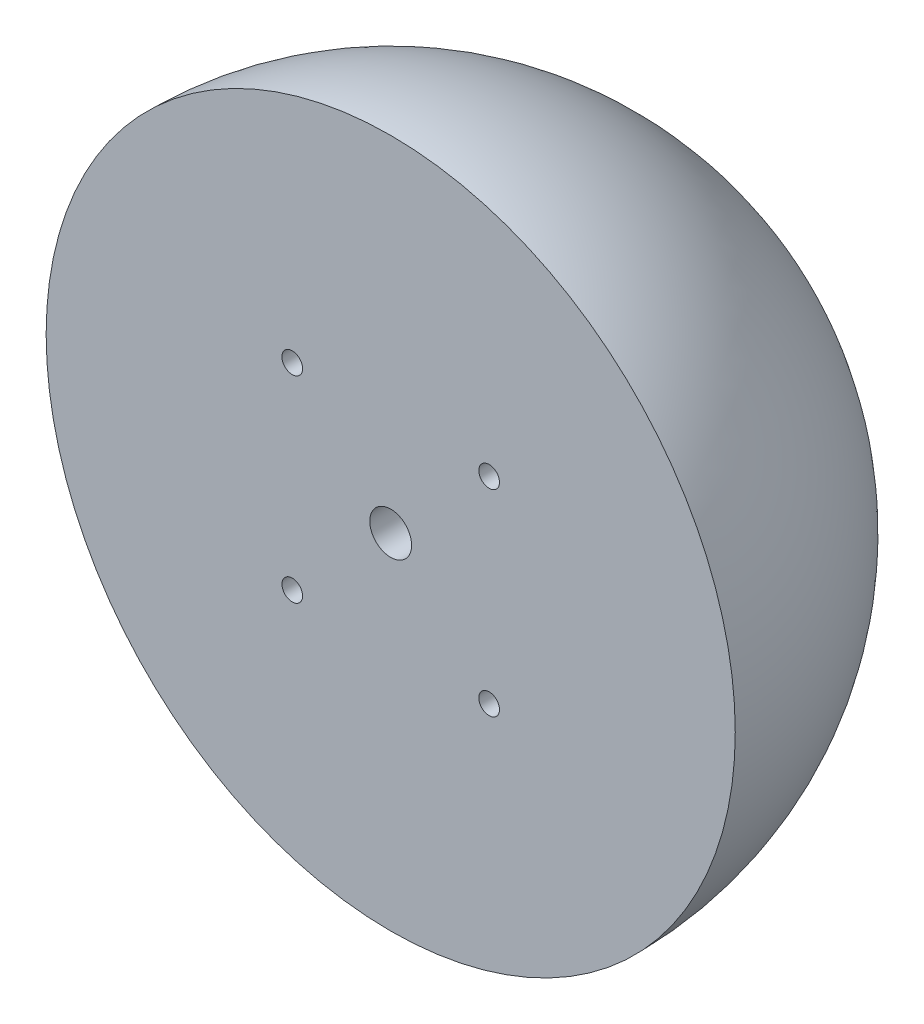
ISO-10303-21;
HEADER;
FILE_DESCRIPTION(('STEP AP214'),'2;1');
FILE_NAME('part.step','',(''),(''),'','','');
FILE_SCHEMA(('AUTOMOTIVE_DESIGN { 1 0 10303 214 1 1 1 1 }'));
ENDSEC;
DATA;
#1=APPLICATION_CONTEXT('core data for automotive mechanical design processes');
#2=APPLICATION_PROTOCOL_DEFINITION('international standard','automotive_design',2000,#1);
#3=PRODUCT_CONTEXT('',#1,'mechanical');
#4=PRODUCT('Part','Part','',(#3));
#5=PRODUCT_RELATED_PRODUCT_CATEGORY('part','',(#4));
#6=PRODUCT_DEFINITION_FORMATION('','',#4);
#7=PRODUCT_DEFINITION_CONTEXT('part definition',#1,'design');
#8=PRODUCT_DEFINITION('design','',#6,#7);
#9=PRODUCT_DEFINITION_SHAPE('','',#8);
#10=(LENGTH_UNIT() NAMED_UNIT(*) SI_UNIT(.MILLI.,.METRE.));
#11=(NAMED_UNIT(*) PLANE_ANGLE_UNIT() SI_UNIT($,.RADIAN.));
#12=(NAMED_UNIT(*) SI_UNIT($,.STERADIAN.) SOLID_ANGLE_UNIT());
#13=UNCERTAINTY_MEASURE_WITH_UNIT(LENGTH_MEASURE(1.E-05),#10,'distance_accuracy_value','');
#14=(GEOMETRIC_REPRESENTATION_CONTEXT(3) GLOBAL_UNCERTAINTY_ASSIGNED_CONTEXT((#13)) GLOBAL_UNIT_ASSIGNED_CONTEXT((#10,
#11,#12)) REPRESENTATION_CONTEXT('',''));
#15=CARTESIAN_POINT('',(0.,0.,0.));
#16=DIRECTION('',(0.,0.,1.));
#17=DIRECTION('',(1.,0.,0.));
#18=AXIS2_PLACEMENT_3D('',#15,#16,#17);
#19=CARTESIAN_POINT('',(0.,0.,0.));
#20=DIRECTION('',(0.,0.,-1.));
#21=DIRECTION('',(-1.,0.,0.));
#22=AXIS2_PLACEMENT_3D('',#19,#20,#21);
#23=PLANE('',#22);
#24=CARTESIAN_POINT('',(-20.,20.,0.));
#25=DIRECTION('',(0.,0.,1.));
#26=DIRECTION('',(1.,0.,0.));
#27=AXIS2_PLACEMENT_3D('',#24,#25,#26);
#28=CIRCLE('',#27,2.1);
#29=CARTESIAN_POINT('',(-17.9,20.,0.));
#30=VERTEX_POINT('',#29);
#31=EDGE_CURVE('E70',#30,#30,#28,.T.);
#32=ORIENTED_EDGE('',*,*,#31,.F.);
#33=EDGE_LOOP('',(#32));
#34=FACE_BOUND('',#33,.T.);
#35=CARTESIAN_POINT('',(20.,20.,0.));
#36=DIRECTION('',(0.,0.,1.));
#37=DIRECTION('',(1.,0.,0.));
#38=AXIS2_PLACEMENT_3D('',#35,#36,#37);
#39=CIRCLE('',#38,2.1);
#40=CARTESIAN_POINT('',(22.1,20.,0.));
#41=VERTEX_POINT('',#40);
#42=EDGE_CURVE('E69',#41,#41,#39,.T.);
#43=ORIENTED_EDGE('',*,*,#42,.F.);
#44=EDGE_LOOP('',(#43));
#45=FACE_BOUND('',#44,.T.);
#46=CARTESIAN_POINT('',(20.,-20.,0.));
#47=DIRECTION('',(0.,0.,1.));
#48=DIRECTION('',(1.,0.,0.));
#49=AXIS2_PLACEMENT_3D('',#46,#47,#48);
#50=CIRCLE('',#49,2.1);
#51=CARTESIAN_POINT('',(22.1,-20.,0.));
#52=VERTEX_POINT('',#51);
#53=EDGE_CURVE('E80',#52,#52,#50,.T.);
#54=ORIENTED_EDGE('',*,*,#53,.F.);
#55=EDGE_LOOP('',(#54));
#56=FACE_BOUND('',#55,.T.);
#57=CARTESIAN_POINT('',(-20.,-20.,0.));
#58=DIRECTION('',(0.,0.,1.));
#59=DIRECTION('',(1.,0.,0.));
#60=AXIS2_PLACEMENT_3D('',#57,#58,#59);
#61=CIRCLE('',#60,2.1);
#62=CARTESIAN_POINT('',(-17.9,-20.,0.));
#63=VERTEX_POINT('',#62);
#64=EDGE_CURVE('E86',#63,#63,#61,.T.);
#65=ORIENTED_EDGE('',*,*,#64,.F.);
#66=EDGE_LOOP('',(#65));
#67=FACE_BOUND('',#66,.T.);
#68=CARTESIAN_POINT('',(0.,0.,0.));
#69=DIRECTION('',(0.,0.,1.));
#70=DIRECTION('',(1.,0.,0.));
#71=AXIS2_PLACEMENT_3D('',#68,#69,#70);
#72=CIRCLE('',#71,4.24999999999999);
#73=CARTESIAN_POINT('',(4.24999999999999,0.,0.));
#74=VERTEX_POINT('',#73);
#75=EDGE_CURVE('E92',#74,#74,#72,.T.);
#76=ORIENTED_EDGE('',*,*,#75,.F.);
#77=EDGE_LOOP('',(#76));
#78=FACE_BOUND('',#77,.T.);
#79=CARTESIAN_POINT('',(0.,0.,0.));
#80=DIRECTION('',(0.,0.,-1.));
#81=DIRECTION('',(-1.,0.,0.));
#82=AXIS2_PLACEMENT_3D('',#79,#80,#81);
#83=CIRCLE('',#82,70.);
#84=CARTESIAN_POINT('',(-70.,0.,0.));
#85=VERTEX_POINT('',#84);
#86=EDGE_CURVE('E11',#85,#85,#83,.T.);
#87=ORIENTED_EDGE('',*,*,#86,.F.);
#88=EDGE_LOOP('',(#87));
#89=FACE_BOUND('',#88,.T.);
#90=ADVANCED_FACE('F36',(#34,#45,#56,#67,#78,#89),#23,.F.);
#91=CARTESIAN_POINT('',(0.,0.,0.));
#92=DIRECTION('',(0.,0.,-1.));
#93=DIRECTION('',(1.,0.,0.));
#94=AXIS2_PLACEMENT_3D('',#91,#92,#93);
#95=SPHERICAL_SURFACE('',#94,70.);
#96=ORIENTED_EDGE('',*,*,#86,.T.);
#97=EDGE_LOOP('',(#96));
#98=FACE_BOUND('',#97,.T.);
#99=ADVANCED_FACE('F108',(#98),#95,.T.);
#100=CARTESIAN_POINT('',(0.,0.,-30.));
#101=DIRECTION('',(0.,0.,1.));
#102=DIRECTION('',(1.,0.,0.));
#103=AXIS2_PLACEMENT_3D('',#100,#101,#102);
#104=CONICAL_SURFACE('',#103,4.24999999999999,1.02974425867665);
#105=CARTESIAN_POINT('',(0.,0.,-32.5536576308671));
#106=VERTEX_POINT('',#105);
#107=VERTEX_LOOP('',#106);
#108=FACE_BOUND('',#107,.T.);
#109=CARTESIAN_POINT('',(0.,0.,-30.));
#110=DIRECTION('',(0.,0.,1.));
#111=DIRECTION('',(1.,0.,0.));
#112=AXIS2_PLACEMENT_3D('',#109,#110,#111);
#113=CIRCLE('',#112,4.24999999999999);
#114=CARTESIAN_POINT('',(4.24999999999999,0.,-30.));
#115=VERTEX_POINT('',#114);
#116=EDGE_CURVE('E43',#115,#115,#113,.T.);
#117=ORIENTED_EDGE('',*,*,#116,.T.);
#118=EDGE_LOOP('',(#117));
#119=FACE_BOUND('',#118,.T.);
#120=ADVANCED_FACE('F97',(#108,#119),#104,.F.);
#121=CARTESIAN_POINT('',(0.,0.,0.));
#122=DIRECTION('',(0.,0.,1.));
#123=DIRECTION('',(1.,0.,0.));
#124=AXIS2_PLACEMENT_3D('',#121,#122,#123);
#125=CYLINDRICAL_SURFACE('',#124,4.24999999999999);
#126=ORIENTED_EDGE('',*,*,#116,.F.);
#127=EDGE_LOOP('',(#126));
#128=FACE_BOUND('',#127,.T.);
#129=ORIENTED_EDGE('',*,*,#75,.T.);
#130=EDGE_LOOP('',(#129));
#131=FACE_BOUND('',#130,.T.);
#132=ADVANCED_FACE('F99',(#128,#131),#125,.F.);
#133=CARTESIAN_POINT('',(-20.,-20.,-20.));
#134=DIRECTION('',(0.,0.,1.));
#135=DIRECTION('',(1.,0.,0.));
#136=AXIS2_PLACEMENT_3D('',#133,#134,#135);
#137=CONICAL_SURFACE('',#136,2.09999999999999,1.02974425867665);
#138=CARTESIAN_POINT('',(-20.,-20.,-21.2618072999579));
#139=VERTEX_POINT('',#138);
#140=VERTEX_LOOP('',#139);
#141=FACE_BOUND('',#140,.T.);
#142=CARTESIAN_POINT('',(-20.,-20.,-20.));
#143=DIRECTION('',(0.,0.,1.));
#144=DIRECTION('',(1.,0.,0.));
#145=AXIS2_PLACEMENT_3D('',#142,#143,#144);
#146=CIRCLE('',#145,2.09999999999999);
#147=CARTESIAN_POINT('',(-17.9,-20.,-20.));
#148=VERTEX_POINT('',#147);
#149=EDGE_CURVE('E89',#148,#148,#146,.T.);
#150=ORIENTED_EDGE('',*,*,#149,.T.);
#151=EDGE_LOOP('',(#150));
#152=FACE_BOUND('',#151,.T.);
#153=ADVANCED_FACE('F102',(#141,#152),#137,.F.);
#154=CARTESIAN_POINT('',(-20.,-20.,0.));
#155=DIRECTION('',(0.,0.,1.));
#156=DIRECTION('',(1.,0.,0.));
#157=AXIS2_PLACEMENT_3D('',#154,#155,#156);
#158=CYLINDRICAL_SURFACE('',#157,2.1);
#159=ORIENTED_EDGE('',*,*,#149,.F.);
#160=EDGE_LOOP('',(#159));
#161=FACE_BOUND('',#160,.T.);
#162=ORIENTED_EDGE('',*,*,#64,.T.);
#163=EDGE_LOOP('',(#162));
#164=FACE_BOUND('',#163,.T.);
#165=ADVANCED_FACE('F120',(#161,#164),#158,.F.);
#166=CARTESIAN_POINT('',(20.,-20.,-20.));
#167=DIRECTION('',(0.,0.,1.));
#168=DIRECTION('',(1.,0.,0.));
#169=AXIS2_PLACEMENT_3D('',#166,#167,#168);
#170=CONICAL_SURFACE('',#169,2.09999999999999,1.02974425867665);
#171=CARTESIAN_POINT('',(20.,-20.,-21.2618072999579));
#172=VERTEX_POINT('',#171);
#173=VERTEX_LOOP('',#172);
#174=FACE_BOUND('',#173,.T.);
#175=CARTESIAN_POINT('',(20.,-20.,-20.));
#176=DIRECTION('',(0.,0.,1.));
#177=DIRECTION('',(1.,0.,0.));
#178=AXIS2_PLACEMENT_3D('',#175,#176,#177);
#179=CIRCLE('',#178,2.09999999999999);
#180=CARTESIAN_POINT('',(22.1,-20.,-20.));
#181=VERTEX_POINT('',#180);
#182=EDGE_CURVE('E83',#181,#181,#179,.T.);
#183=ORIENTED_EDGE('',*,*,#182,.T.);
#184=EDGE_LOOP('',(#183));
#185=FACE_BOUND('',#184,.T.);
#186=ADVANCED_FACE('F123',(#174,#185),#170,.F.);
#187=CARTESIAN_POINT('',(20.,-20.,0.));
#188=DIRECTION('',(0.,0.,1.));
#189=DIRECTION('',(1.,0.,0.));
#190=AXIS2_PLACEMENT_3D('',#187,#188,#189);
#191=CYLINDRICAL_SURFACE('',#190,2.1);
#192=ORIENTED_EDGE('',*,*,#182,.F.);
#193=EDGE_LOOP('',(#192));
#194=FACE_BOUND('',#193,.T.);
#195=ORIENTED_EDGE('',*,*,#53,.T.);
#196=EDGE_LOOP('',(#195));
#197=FACE_BOUND('',#196,.T.);
#198=ADVANCED_FACE('F127',(#194,#197),#191,.F.);
#199=CARTESIAN_POINT('',(20.,20.,-20.));
#200=DIRECTION('',(0.,0.,1.));
#201=DIRECTION('',(1.,0.,0.));
#202=AXIS2_PLACEMENT_3D('',#199,#200,#201);
#203=CONICAL_SURFACE('',#202,2.09999999999999,1.02974425867665);
#204=CARTESIAN_POINT('',(20.,20.,-21.2618072999579));
#205=VERTEX_POINT('',#204);
#206=VERTEX_LOOP('',#205);
#207=FACE_BOUND('',#206,.T.);
#208=CARTESIAN_POINT('',(20.,20.,-20.));
#209=DIRECTION('',(0.,0.,1.));
#210=DIRECTION('',(1.,0.,0.));
#211=AXIS2_PLACEMENT_3D('',#208,#209,#210);
#212=CIRCLE('',#211,2.09999999999999);
#213=CARTESIAN_POINT('',(22.1,20.,-20.));
#214=VERTEX_POINT('',#213);
#215=EDGE_CURVE('E73',#214,#214,#212,.T.);
#216=ORIENTED_EDGE('',*,*,#215,.T.);
#217=EDGE_LOOP('',(#216));
#218=FACE_BOUND('',#217,.T.);
#219=ADVANCED_FACE('F131',(#207,#218),#203,.F.);
#220=CARTESIAN_POINT('',(20.,20.,0.));
#221=DIRECTION('',(0.,0.,1.));
#222=DIRECTION('',(1.,0.,0.));
#223=AXIS2_PLACEMENT_3D('',#220,#221,#222);
#224=CYLINDRICAL_SURFACE('',#223,2.1);
#225=ORIENTED_EDGE('',*,*,#215,.F.);
#226=EDGE_LOOP('',(#225));
#227=FACE_BOUND('',#226,.T.);
#228=ORIENTED_EDGE('',*,*,#42,.T.);
#229=EDGE_LOOP('',(#228));
#230=FACE_BOUND('',#229,.T.);
#231=ADVANCED_FACE('F63',(#227,#230),#224,.F.);
#232=CARTESIAN_POINT('',(-20.,20.,-20.));
#233=DIRECTION('',(0.,0.,1.));
#234=DIRECTION('',(1.,0.,0.));
#235=AXIS2_PLACEMENT_3D('',#232,#233,#234);
#236=CONICAL_SURFACE('',#235,2.09999999999999,1.02974425867665);
#237=CARTESIAN_POINT('',(-20.,20.,-21.2618072999579));
#238=VERTEX_POINT('',#237);
#239=VERTEX_LOOP('',#238);
#240=FACE_BOUND('',#239,.T.);
#241=CARTESIAN_POINT('',(-20.,20.,-20.));
#242=DIRECTION('',(0.,0.,1.));
#243=DIRECTION('',(1.,0.,0.));
#244=AXIS2_PLACEMENT_3D('',#241,#242,#243);
#245=CIRCLE('',#244,2.09999999999999);
#246=CARTESIAN_POINT('',(-17.9,20.,-20.));
#247=VERTEX_POINT('',#246);
#248=EDGE_CURVE('E67',#247,#247,#245,.T.);
#249=ORIENTED_EDGE('',*,*,#248,.T.);
#250=EDGE_LOOP('',(#249));
#251=FACE_BOUND('',#250,.T.);
#252=ADVANCED_FACE('F59',(#240,#251),#236,.F.);
#253=CARTESIAN_POINT('',(-20.,20.,0.));
#254=DIRECTION('',(0.,0.,1.));
#255=DIRECTION('',(1.,0.,0.));
#256=AXIS2_PLACEMENT_3D('',#253,#254,#255);
#257=CYLINDRICAL_SURFACE('',#256,2.1);
#258=ORIENTED_EDGE('',*,*,#248,.F.);
#259=EDGE_LOOP('',(#258));
#260=FACE_BOUND('',#259,.T.);
#261=ORIENTED_EDGE('',*,*,#31,.T.);
#262=EDGE_LOOP('',(#261));
#263=FACE_BOUND('',#262,.T.);
#264=ADVANCED_FACE('F62',(#260,#263),#257,.F.);
#265=CLOSED_SHELL('',(#90,#99,#120,#132,#153,#165,#186,#198,#219,#231,#252,#264));
#266=MANIFOLD_SOLID_BREP('B2',#265);
#267=ADVANCED_BREP_SHAPE_REPRESENTATION('',(#18,#266),#14);
#268=SHAPE_DEFINITION_REPRESENTATION(#9,#267);
ENDSEC;
END-ISO-10303-21;
